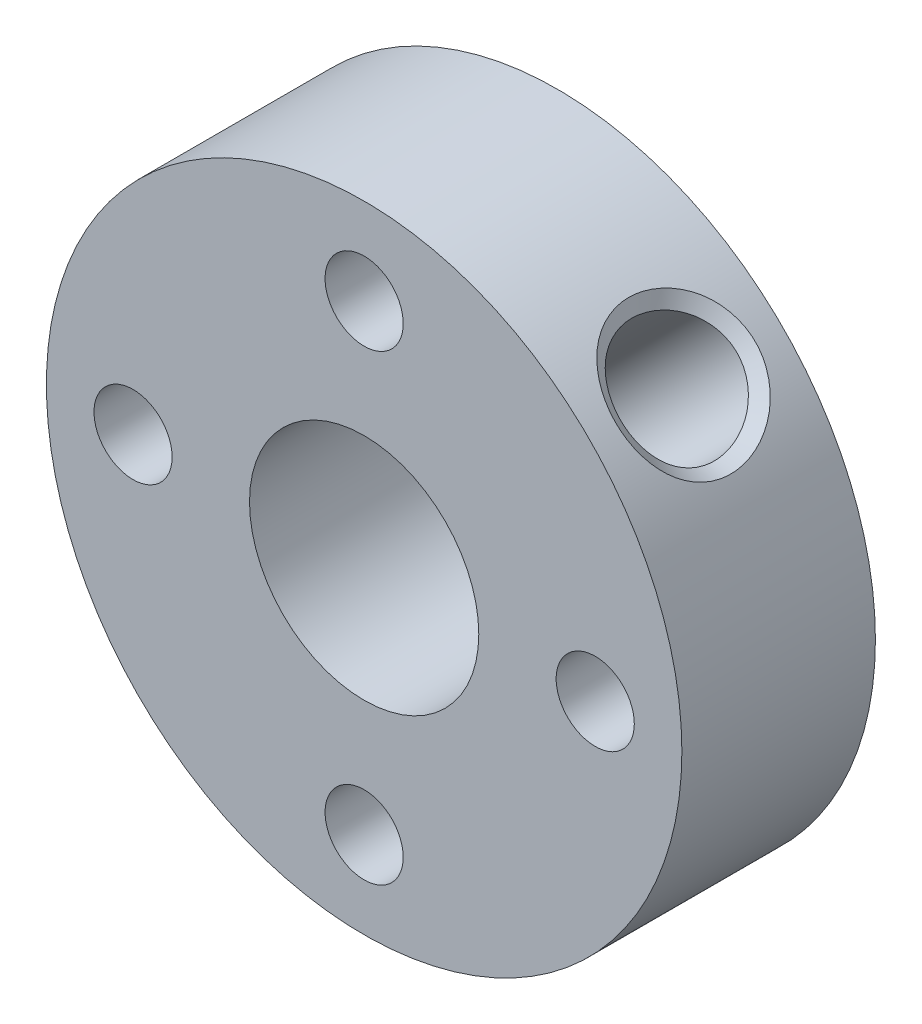
ISO-10303-21;
HEADER;
FILE_DESCRIPTION(('STEP AP214'),'2;1');
FILE_NAME('part.step','',(''),(''),'','','');
FILE_SCHEMA(('AUTOMOTIVE_DESIGN { 1 0 10303 214 1 1 1 1 }'));
ENDSEC;
DATA;
#1=APPLICATION_CONTEXT('core data for automotive mechanical design processes');
#2=APPLICATION_PROTOCOL_DEFINITION('international standard','automotive_design',2000,#1);
#3=PRODUCT_CONTEXT('',#1,'mechanical');
#4=PRODUCT('Part','Part','',(#3));
#5=PRODUCT_RELATED_PRODUCT_CATEGORY('part','',(#4));
#6=PRODUCT_DEFINITION_FORMATION('','',#4);
#7=PRODUCT_DEFINITION_CONTEXT('part definition',#1,'design');
#8=PRODUCT_DEFINITION('design','',#6,#7);
#9=PRODUCT_DEFINITION_SHAPE('','',#8);
#10=(LENGTH_UNIT() NAMED_UNIT(*) SI_UNIT(.MILLI.,.METRE.));
#11=(NAMED_UNIT(*) PLANE_ANGLE_UNIT() SI_UNIT($,.RADIAN.));
#12=(NAMED_UNIT(*) SI_UNIT($,.STERADIAN.) SOLID_ANGLE_UNIT());
#13=UNCERTAINTY_MEASURE_WITH_UNIT(LENGTH_MEASURE(1.E-05),#10,'distance_accuracy_value','');
#14=(GEOMETRIC_REPRESENTATION_CONTEXT(3) GLOBAL_UNCERTAINTY_ASSIGNED_CONTEXT((#13)) GLOBAL_UNIT_ASSIGNED_CONTEXT((#10,
#11,#12)) REPRESENTATION_CONTEXT('',''));
#15=CARTESIAN_POINT('',(0.,0.,0.));
#16=DIRECTION('',(0.,0.,1.));
#17=DIRECTION('',(1.,0.,0.));
#18=AXIS2_PLACEMENT_3D('',#15,#16,#17);
#19=CARTESIAN_POINT('',(0.,0.,-3.35));
#20=DIRECTION('',(0.,0.,1.));
#21=DIRECTION('',(1.,0.,0.));
#22=AXIS2_PLACEMENT_3D('',#19,#20,#21);
#23=CYLINDRICAL_SURFACE('',#22,11.);
#24=CARTESIAN_POINT('',(5.8085092111497,9.34137145948008,0.));
#25=CARTESIAN_POINT('',(5.80860175270185,9.34130684226353,0.637752239425181));
#26=CARTESIAN_POINT('',(6.04841944563921,9.19795689630476,1.26506432985481));
#27=CARTESIAN_POINT('',(6.80772994268231,8.65475782457621,2.1593530444314));
#28=CARTESIAN_POINT('',(7.31255506753503,8.2438399198522,2.42181611028022));
#29=CARTESIAN_POINT('',(8.24208780154511,7.31421539613682,2.42137394363942));
#30=CARTESIAN_POINT('',(8.65342910417239,6.80927509037896,2.16023058528548));
#31=CARTESIAN_POINT('',(9.19833006953286,6.04820111625001,1.26575073384544));
#32=CARTESIAN_POINT('',(9.34130756360717,5.80859981124356,0.640244269694809));
#33=CARTESIAN_POINT('',(9.34143535072447,5.80841861849953,-0.63996115444348));
#34=CARTESIAN_POINT('',(9.19862099961548,6.04773368941901,-1.26485137218771));
#35=CARTESIAN_POINT('',(8.65403117260026,6.80850255677219,-2.15966842361701));
#36=CARTESIAN_POINT('',(8.24214650834189,7.31418190369821,-2.42143639363606));
#37=CARTESIAN_POINT('',(7.31242801405934,8.24394174367863,-2.42175361413118));
#38=CARTESIAN_POINT('',(6.80825671047603,8.65433029295559,-2.15959971653595));
#39=CARTESIAN_POINT('',(6.04869975760827,9.19780320357039,-1.26576913530238));
#40=CARTESIAN_POINT('',(5.80841666959755,9.34143607669663,-0.637752239425182));
#41=CARTESIAN_POINT('',(5.8085092111497,9.34137145948008,0.));
#42=B_SPLINE_CURVE_WITH_KNOTS('',3,(#24,#25,#26,#27,#28,#29,#30,#31,#32,#33,#34,#35,#36,#37,#38,
#39,#40,#41),.UNSPECIFIED.,.T.,.F.,(4,2,2,2,2,2,2,2,4),(-3.18999496817796E-06,
0.00189587305523978,0.00379493610544774,0.0056939991556557,0.00759306220586365,
0.00949212525607161,0.0113911883062796,0.0132902513564875,0.0151893144066955),.UNSPECIFIED.);
#43=CARTESIAN_POINT('',(5.8085092111497,9.34137145948008,0.));
#44=VERTEX_POINT('',#43);
#45=EDGE_CURVE('E10',#44,#44,#42,.F.);
#46=ORIENTED_EDGE('',*,*,#45,.T.);
#47=EDGE_LOOP('',(#46));
#48=FACE_BOUND('',#47,.T.);
#49=CARTESIAN_POINT('',(0.,0.,-3.35));
#50=DIRECTION('',(0.,0.,1.));
#51=DIRECTION('',(1.,0.,0.));
#52=AXIS2_PLACEMENT_3D('',#49,#50,#51);
#53=CIRCLE('',#52,11.);
#54=CARTESIAN_POINT('',(11.,0.,-3.35));
#55=VERTEX_POINT('',#54);
#56=EDGE_CURVE('E49',#55,#55,#53,.T.);
#57=ORIENTED_EDGE('',*,*,#56,.T.);
#58=EDGE_LOOP('',(#57));
#59=FACE_BOUND('',#58,.T.);
#60=CARTESIAN_POINT('',(0.,0.,3.35));
#61=DIRECTION('',(0.,0.,1.));
#62=DIRECTION('',(1.,0.,0.));
#63=AXIS2_PLACEMENT_3D('',#60,#61,#62);
#64=CIRCLE('',#63,11.);
#65=CARTESIAN_POINT('',(11.,0.,3.35));
#66=VERTEX_POINT('',#65);
#67=EDGE_CURVE('E54',#66,#66,#64,.T.);
#68=ORIENTED_EDGE('',*,*,#67,.F.);
#69=EDGE_LOOP('',(#68));
#70=FACE_BOUND('',#69,.T.);
#71=ADVANCED_FACE('F32',(#48,#59,#70),#23,.T.);
#72=CARTESIAN_POINT('',(0.,0.,-3.35));
#73=DIRECTION('',(0.,0.,1.));
#74=DIRECTION('',(1.,0.,0.));
#75=AXIS2_PLACEMENT_3D('',#72,#73,#74);
#76=PLANE('',#75);
#77=CARTESIAN_POINT('',(0.,8.,-3.35));
#78=DIRECTION('',(0.,0.,1.));
#79=DIRECTION('',(1.,0.,0.));
#80=AXIS2_PLACEMENT_3D('',#77,#78,#79);
#81=CIRCLE('',#80,1.35255);
#82=CARTESIAN_POINT('',(1.35255,8.,-3.35));
#83=VERTEX_POINT('',#82);
#84=EDGE_CURVE('E177',#83,#83,#81,.T.);
#85=ORIENTED_EDGE('',*,*,#84,.T.);
#86=EDGE_LOOP('',(#85));
#87=FACE_BOUND('',#86,.T.);
#88=CARTESIAN_POINT('',(-8.,0.,-3.35));
#89=DIRECTION('',(0.,0.,1.));
#90=DIRECTION('',(1.,0.,0.));
#91=AXIS2_PLACEMENT_3D('',#88,#89,#90);
#92=CIRCLE('',#91,1.35255);
#93=CARTESIAN_POINT('',(-6.64745,0.,-3.35));
#94=VERTEX_POINT('',#93);
#95=EDGE_CURVE('E171',#94,#94,#92,.T.);
#96=ORIENTED_EDGE('',*,*,#95,.T.);
#97=EDGE_LOOP('',(#96));
#98=FACE_BOUND('',#97,.T.);
#99=CARTESIAN_POINT('',(8.,0.,-3.35));
#100=DIRECTION('',(0.,0.,1.));
#101=DIRECTION('',(1.,0.,0.));
#102=AXIS2_PLACEMENT_3D('',#99,#100,#101);
#103=CIRCLE('',#102,1.35255);
#104=CARTESIAN_POINT('',(9.35255,0.,-3.35));
#105=VERTEX_POINT('',#104);
#106=EDGE_CURVE('E158',#105,#105,#103,.T.);
#107=ORIENTED_EDGE('',*,*,#106,.T.);
#108=EDGE_LOOP('',(#107));
#109=FACE_BOUND('',#108,.T.);
#110=CARTESIAN_POINT('',(0.,-8.,-3.35));
#111=DIRECTION('',(0.,0.,1.));
#112=DIRECTION('',(1.,0.,0.));
#113=AXIS2_PLACEMENT_3D('',#110,#111,#112);
#114=CIRCLE('',#113,1.35255);
#115=CARTESIAN_POINT('',(1.35255,-8.,-3.35));
#116=VERTEX_POINT('',#115);
#117=EDGE_CURVE('E163',#116,#116,#114,.T.);
#118=ORIENTED_EDGE('',*,*,#117,.T.);
#119=EDGE_LOOP('',(#118));
#120=FACE_BOUND('',#119,.T.);
#121=CARTESIAN_POINT('',(0.,0.,-3.35));
#122=DIRECTION('',(0.,0.,1.));
#123=DIRECTION('',(1.,0.,0.));
#124=AXIS2_PLACEMENT_3D('',#121,#122,#123);
#125=CIRCLE('',#124,3.96875);
#126=CARTESIAN_POINT('',(3.96875,0.,-3.35));
#127=VERTEX_POINT('',#126);
#128=EDGE_CURVE('E59',#127,#127,#125,.T.);
#129=ORIENTED_EDGE('',*,*,#128,.T.);
#130=EDGE_LOOP('',(#129));
#131=FACE_BOUND('',#130,.T.);
#132=ORIENTED_EDGE('',*,*,#56,.F.);
#133=EDGE_LOOP('',(#132));
#134=FACE_BOUND('',#133,.T.);
#135=ADVANCED_FACE('F103',(#87,#98,#109,#120,#131,#134),#76,.F.);
#136=CARTESIAN_POINT('',(0.,0.,3.35));
#137=DIRECTION('',(0.,0.,1.));
#138=DIRECTION('',(1.,0.,0.));
#139=AXIS2_PLACEMENT_3D('',#136,#137,#138);
#140=PLANE('',#139);
#141=CARTESIAN_POINT('',(0.,8.,3.35));
#142=DIRECTION('',(0.,0.,1.));
#143=DIRECTION('',(1.,0.,0.));
#144=AXIS2_PLACEMENT_3D('',#141,#142,#143);
#145=CIRCLE('',#144,1.35254999999999);
#146=CARTESIAN_POINT('',(1.35254999999999,8.,3.35));
#147=VERTEX_POINT('',#146);
#148=EDGE_CURVE('E174',#147,#147,#145,.T.);
#149=ORIENTED_EDGE('',*,*,#148,.F.);
#150=EDGE_LOOP('',(#149));
#151=FACE_BOUND('',#150,.T.);
#152=CARTESIAN_POINT('',(-8.,0.,3.35));
#153=DIRECTION('',(0.,0.,1.));
#154=DIRECTION('',(1.,0.,0.));
#155=AXIS2_PLACEMENT_3D('',#152,#153,#154);
#156=CIRCLE('',#155,1.35254999999999);
#157=CARTESIAN_POINT('',(-6.64745000000001,0.,3.35));
#158=VERTEX_POINT('',#157);
#159=EDGE_CURVE('E166',#158,#158,#156,.T.);
#160=ORIENTED_EDGE('',*,*,#159,.F.);
#161=EDGE_LOOP('',(#160));
#162=FACE_BOUND('',#161,.T.);
#163=CARTESIAN_POINT('',(8.,0.,3.35));
#164=DIRECTION('',(0.,0.,1.));
#165=DIRECTION('',(1.,0.,0.));
#166=AXIS2_PLACEMENT_3D('',#163,#164,#165);
#167=CIRCLE('',#166,1.35254999999999);
#168=CARTESIAN_POINT('',(9.35254999999999,0.,3.35));
#169=VERTEX_POINT('',#168);
#170=EDGE_CURVE('E161',#169,#169,#167,.T.);
#171=ORIENTED_EDGE('',*,*,#170,.F.);
#172=EDGE_LOOP('',(#171));
#173=FACE_BOUND('',#172,.T.);
#174=CARTESIAN_POINT('',(0.,-8.,3.35));
#175=DIRECTION('',(0.,0.,1.));
#176=DIRECTION('',(1.,0.,0.));
#177=AXIS2_PLACEMENT_3D('',#174,#175,#176);
#178=CIRCLE('',#177,1.35254999999999);
#179=CARTESIAN_POINT('',(1.35254999999999,-8.,3.35));
#180=VERTEX_POINT('',#179);
#181=EDGE_CURVE('E91',#180,#180,#178,.T.);
#182=ORIENTED_EDGE('',*,*,#181,.F.);
#183=EDGE_LOOP('',(#182));
#184=FACE_BOUND('',#183,.T.);
#185=CARTESIAN_POINT('',(0.,0.,3.35));
#186=DIRECTION('',(0.,0.,1.));
#187=DIRECTION('',(1.,0.,0.));
#188=AXIS2_PLACEMENT_3D('',#185,#186,#187);
#189=CIRCLE('',#188,3.96875);
#190=CARTESIAN_POINT('',(3.96875,0.,3.35));
#191=VERTEX_POINT('',#190);
#192=EDGE_CURVE('E62',#191,#191,#189,.T.);
#193=ORIENTED_EDGE('',*,*,#192,.F.);
#194=EDGE_LOOP('',(#193));
#195=FACE_BOUND('',#194,.T.);
#196=ORIENTED_EDGE('',*,*,#67,.T.);
#197=EDGE_LOOP('',(#196));
#198=FACE_BOUND('',#197,.T.);
#199=ADVANCED_FACE('F100',(#151,#162,#173,#184,#195,#198),#140,.T.);
#200=CARTESIAN_POINT('',(0.,0.,-3.35));
#201=DIRECTION('',(0.,0.,1.));
#202=DIRECTION('',(1.,0.,0.));
#203=AXIS2_PLACEMENT_3D('',#200,#201,#202);
#204=CYLINDRICAL_SURFACE('',#203,3.96875);
#205=CARTESIAN_POINT('',(0.988066021552106,3.84378746805208,0.));
#206=CARTESIAN_POINT('',(0.988079902541116,3.84378895007629,0.104927856551472));
#207=CARTESIAN_POINT('',(0.997359113943265,3.84143565622422,0.209985951877965));
#208=CARTESIAN_POINT('',(1.0336680659886,3.83181885188441,0.416851766777404));
#209=CARTESIAN_POINT('',(1.06073378291078,3.82454538862704,0.518652459109406));
#210=CARTESIAN_POINT('',(1.13022299693377,3.80458397320029,0.715620498990882));
#211=CARTESIAN_POINT('',(1.17256250905059,3.79192556393313,0.810820791319395));
#212=CARTESIAN_POINT('',(1.26993094348076,3.7604338013933,0.993320316996597));
#213=CARTESIAN_POINT('',(1.32496093160809,3.7415999294162,1.08061888585833));
#214=CARTESIAN_POINT('',(1.4502174154329,3.6949530461915,1.25308159207338));
#215=CARTESIAN_POINT('',(1.52134137800284,3.66650955234386,1.33742373732139));
#216=CARTESIAN_POINT('',(1.6723052454782,3.60016282906435,1.49374573019937));
#217=CARTESIAN_POINT('',(1.75214959794203,3.56225475973178,1.56571922097949));
#218=CARTESIAN_POINT('',(1.92334854127002,3.47298942710684,1.70022656254003));
#219=CARTESIAN_POINT('',(2.0151177350485,3.42087311221871,1.76173889279822));
#220=CARTESIAN_POINT('',(2.20120105356201,3.30419656521406,1.86639760992893));
#221=CARTESIAN_POINT('',(2.29551347325045,3.23964450033303,1.90955599149707));
#222=CARTESIAN_POINT('',(2.47562329768691,3.10387451128038,1.97299149618751));
#223=CARTESIAN_POINT('',(2.56153840302111,3.03349117405402,1.99471305588314));
#224=CARTESIAN_POINT('',(2.72850970041959,2.88421930798347,2.01942570035065));
#225=CARTESIAN_POINT('',(2.80956892130637,2.80533616861374,2.02242858381395));
#226=CARTESIAN_POINT('',(2.95694466876338,2.64914129463903,2.01015199009899));
#227=CARTESIAN_POINT('',(3.02393145385511,2.57232673696917,1.99649311009036));
#228=CARTESIAN_POINT('',(3.14995684203534,2.41636142335379,1.95419547289651));
#229=CARTESIAN_POINT('',(3.20899484801796,2.33721049244571,1.92555559113911));
#230=CARTESIAN_POINT('',(3.31908779594534,2.17810180971991,1.85395095981867));
#231=CARTESIAN_POINT('',(3.37002491830902,2.09814749264745,1.81079905149489));
#232=CARTESIAN_POINT('',(3.46290403064262,1.94103413705174,1.71166853890331));
#233=CARTESIAN_POINT('',(3.50484283192848,1.86387609745267,1.65568540219259));
#234=CARTESIAN_POINT('',(3.58382388815284,1.70750678416115,1.5262546139572));
#235=CARTESIAN_POINT('',(3.6199970261924,1.62882188057161,1.45163987808151));
#236=CARTESIAN_POINT('',(3.68305818293236,1.48072646230621,1.29017340154659));
#237=CARTESIAN_POINT('',(3.70993863236889,1.41132353624781,1.20331176599065));
#238=CARTESIAN_POINT('',(3.75708089385763,1.28080324032226,1.01266300006345));
#239=CARTESIAN_POINT('',(3.77677370342606,1.2205609670457,0.908129278653179));
#240=CARTESIAN_POINT('',(3.80819276088697,1.11871027030587,0.689253213204128));
#241=CARTESIAN_POINT('',(3.8199275534277,1.0770818772442,0.574921538480598));
#242=CARTESIAN_POINT('',(3.83586302371067,1.01881432623523,0.349292450928628));
#243=CARTESIAN_POINT('',(3.84059152655263,1.00044180772154,0.238484555747576));
#244=CARTESIAN_POINT('',(3.84467034847992,0.984666788253275,0.0153190940584518));
#245=CARTESIAN_POINT('',(3.84402479071221,0.987248210743566,-0.0970372183887345));
#246=CARTESIAN_POINT('',(3.83768926688075,1.01154768021783,-0.306285889223869));
#247=CARTESIAN_POINT('',(3.83258914996281,1.03102629884983,-0.403468276542667));
#248=CARTESIAN_POINT('',(3.81777315440258,1.08459721795761,-0.593338244190524));
#249=CARTESIAN_POINT('',(3.80805571029018,1.11869447438943,-0.686024288313387));
#250=CARTESIAN_POINT('',(3.78285711500173,1.2012088615821,-0.869141295505289));
#251=CARTESIAN_POINT('',(3.76713121285842,1.25021297597341,-0.959271996815906));
#252=CARTESIAN_POINT('',(3.72917596633653,1.35924768170892,-1.13110010124883));
#253=CARTESIAN_POINT('',(3.70694326990453,1.4192839504532,-1.21279312818116));
#254=CARTESIAN_POINT('',(3.65168327891228,1.55638441929068,-1.37666632676823));
#255=CARTESIAN_POINT('',(3.61762119365603,1.63464956857404,-1.45749894372438));
#256=CARTESIAN_POINT('',(3.5388740045432,1.79878642690377,-1.60513146946906));
#257=CARTESIAN_POINT('',(3.49418491253164,1.88466098403699,-1.6719260922397));
#258=CARTESIAN_POINT('',(3.39186160946718,2.06328504915796,-1.7913214795364));
#259=CARTESIAN_POINT('',(3.33387882619923,2.15616359207096,-1.8434355346827));
#260=CARTESIAN_POINT('',(3.20579420795771,2.34234537613327,-1.928449225566));
#261=CARTESIAN_POINT('',(3.13570345543774,2.43564815359813,-1.96136631281111));
#262=CARTESIAN_POINT('',(2.99180655270109,2.60990913364403,-2.00412288627952));
#263=CARTESIAN_POINT('',(2.91896496918987,2.69120453013022,-2.01583680402985));
#264=CARTESIAN_POINT('',(2.76644500483723,2.84775021696145,-2.02143522084023));
#265=CARTESIAN_POINT('',(2.686769207402,2.92300277091989,-2.01532642849873));
#266=CARTESIAN_POINT('',(2.52910686050123,3.06019007046344,-1.98666783402269));
#267=CARTESIAN_POINT('',(2.45139014021031,3.12268763272809,-1.96529456057147));
#268=CARTESIAN_POINT('',(2.29496968590167,3.23938550840543,-1.90833748226343));
#269=CARTESIAN_POINT('',(2.21626581647025,3.29358466970137,-1.87275170667011));
#270=CARTESIAN_POINT('',(2.05709684530155,3.39538335267928,-1.78685660207557));
#271=CARTESIAN_POINT('',(1.97669508431021,3.44261359261191,-1.73599535996841));
#272=CARTESIAN_POINT('',(1.82009903391039,3.52791441376144,-1.62168189898446));
#273=CARTESIAN_POINT('',(1.74390668086039,3.56598080613233,-1.55822394617094));
#274=CARTESIAN_POINT('',(1.59073453119501,3.63708393211849,-1.41297927787462));
#275=CARTESIAN_POINT('',(1.51447512494284,3.66920466515798,-1.32998035162024));
#276=CARTESIAN_POINT('',(1.37341431743566,3.72430605957277,-1.1519500326916));
#277=CARTESIAN_POINT('',(1.30862369799624,3.74727814538314,-1.05690746026233));
#278=CARTESIAN_POINT('',(1.19205946451786,3.78601440655319,-0.852732732091956));
#279=CARTESIAN_POINT('',(1.14085832928895,3.80147936469973,-0.743208524542081));
#280=CARTESIAN_POINT('',(1.07955124122097,3.81916083666133,-0.573071983833455));
#281=CARTESIAN_POINT('',(1.0617070600374,3.82413333843385,-0.515439060599892));
#282=CARTESIAN_POINT('',(1.03157037760657,3.83237342500356,-0.398634079647876));
#283=CARTESIAN_POINT('',(1.01927404506659,3.83564218663078,-0.33946311404502));
#284=CARTESIAN_POINT('',(1.00268476754273,3.84000721976838,-0.233567736576124));
#285=CARTESIAN_POINT('',(0.997213623023877,3.8414268032206,-0.187038031107455));
#286=CARTESIAN_POINT('',(0.989901029667686,3.84331662818391,-0.0936808862691912));
#287=CARTESIAN_POINT('',(0.988059823275216,3.84378680628393,-0.0468534272220692));
#288=CARTESIAN_POINT('',(0.988066021552106,3.84378746805208,0.));
#289=B_SPLINE_CURVE_WITH_KNOTS('',3,(#205,#206,#207,#208,#209,#210,#211,#212,#213,#214,#215,
#216,#217,#218,#219,#220,#221,#222,#223,#224,#225,#226,#227,#228,#229,#230,#231,#232,#233,#234,
#235,#236,#237,#238,#239,#240,#241,#242,#243,#244,#245,#246,#247,#248,#249,#250,#251,#252,#253,
#254,#255,#256,#257,#258,#259,#260,#261,#262,#263,#264,#265,#266,#267,#268,#269,#270,#271,#272,
#273,#274,#275,#276,#277,#278,#279,#280,#281,#282,#283,#284,#285,#286,#287,#288),.UNSPECIFIED.,
.T.,.F.,(4,2,2,2,2,2,2,2,2,2,2,2,2,2,2,2,2,2,2,2,2,2,2,2,2,2,2,2,2,2,2,2,2,2,2,2,2,2,2,2,2,4),
(0.,0.314593776156156,0.629825839217223,0.943350337013716,1.25690117586846,1.59728492965321,
1.93784310329725,2.30238105637919,2.66668040869054,3.00429585897964,3.34169848312726,
3.64874422629698,3.95581302164109,4.26700442383123,4.57830591968884,4.91979290400179,
5.26155739123993,5.62638332394284,5.99081691444654,6.32608302237146,6.66109192739968,
6.95749709235775,7.25400282304616,7.56415893350386,7.8744751067143,8.22558245452992,
8.57682177615261,8.93861329742309,9.30007540784797,9.62764581054904,9.95509292926405,
10.2596996913262,10.5643487054978,10.8816969366481,11.199189955173,11.549239007761,
11.8996154139391,12.2629980465975,12.4443643777116,12.6256052664879,12.7660714182122,
12.9065469514031),.UNSPECIFIED.);
#290=CARTESIAN_POINT('',(0.988066021552106,3.84378746805208,0.));
#291=VERTEX_POINT('',#290);
#292=EDGE_CURVE('E86',#291,#291,#289,.T.);
#293=ORIENTED_EDGE('',*,*,#292,.T.);
#294=EDGE_LOOP('',(#293));
#295=FACE_BOUND('',#294,.T.);
#296=ORIENTED_EDGE('',*,*,#128,.F.);
#297=EDGE_LOOP('',(#296));
#298=FACE_BOUND('',#297,.T.);
#299=ORIENTED_EDGE('',*,*,#192,.T.);
#300=EDGE_LOOP('',(#299));
#301=FACE_BOUND('',#300,.T.);
#302=ADVANCED_FACE('F80',(#295,#298,#301),#204,.F.);
#303=CARTESIAN_POINT('',(7.77817459305204,7.77817459305201,0.));
#304=DIRECTION('',(0.707106781186549,0.707106781186546,0.));
#305=DIRECTION('',(-0.707106781186546,0.707106781186549,0.));
#306=AXIS2_PLACEMENT_3D('',#303,#304,#305);
#307=CYLINDRICAL_SURFACE('',#306,2.01929999999999);
#308=CARTESIAN_POINT('',(5.91506401697902,8.77078546347897,0.));
#309=CARTESIAN_POINT('',(5.91505848231522,8.77078895441068,-0.0332110676749006));
#310=CARTESIAN_POINT('',(5.91584250371787,8.77036908136087,-0.0664205027333988));
#311=CARTESIAN_POINT('',(5.91894801804011,8.7686844720424,-0.132706000824386));
#312=CARTESIAN_POINT('',(5.9212676546673,8.76742075581777,-0.1657821764358));
#313=CARTESIAN_POINT('',(5.92740096477233,8.76405141279832,-0.231730396913027));
#314=CARTESIAN_POINT('',(5.93121367555311,8.7619463284787,-0.264602559475332));
#315=CARTESIAN_POINT('',(5.94028892447994,8.75689761117119,-0.330073394505811));
#316=CARTESIAN_POINT('',(5.94555114052323,8.7539541644756,-0.3626721260782));
#317=CARTESIAN_POINT('',(5.95748172497235,8.74723181556497,-0.427526437618048));
#318=CARTESIAN_POINT('',(5.96415019887331,8.74345285066972,-0.459781991650093));
#319=CARTESIAN_POINT('',(5.97884975539383,8.73506249034032,-0.523880394046924));
#320=CARTESIAN_POINT('',(5.9868811988934,8.73045087442044,-0.555723130698293));
#321=CARTESIAN_POINT('',(6.00426333819006,8.72039813550141,-0.618926309415737));
#322=CARTESIAN_POINT('',(6.01361451659092,8.71495670899628,-0.650286570375665));
#323=CARTESIAN_POINT('',(6.03359289306655,8.70324720139475,-0.712455190591761));
#324=CARTESIAN_POINT('',(6.04422059736453,8.69697879224987,-0.743263325292283));
#325=CARTESIAN_POINT('',(6.0667088867097,8.68361811087546,-0.804258051751255));
#326=CARTESIAN_POINT('',(6.07856993563722,8.67652552854269,-0.834444404496173));
#327=CARTESIAN_POINT('',(6.10348184418441,8.66151925847352,-0.894125891486487));
#328=CARTESIAN_POINT('',(6.11653308800739,8.65360530547821,-0.923620798638443));
#329=CARTESIAN_POINT('',(6.1437823270195,8.63695899466251,-0.981849692064882));
#330=CARTESIAN_POINT('',(6.15798061459985,8.62822642807898,-1.01058348182968));
#331=CARTESIAN_POINT('',(6.18748098358666,8.60994569245589,-1.06722040540461));
#332=CARTESIAN_POINT('',(6.20278327541986,8.60039736786602,-1.09512337941919));
#333=CARTESIAN_POINT('',(6.23444834486617,8.58048749877546,-1.15002897367341));
#334=CARTESIAN_POINT('',(6.25081127954805,8.57012583378044,-1.17703145966051));
#335=CARTESIAN_POINT('',(6.28455556770698,8.54859326407028,-1.23006622575013));
#336=CARTESIAN_POINT('',(6.30193706947595,8.53742224146553,-1.25609836367374));
#337=CARTESIAN_POINT('',(6.33767164204863,8.51426907303072,-1.30712323462615));
#338=CARTESIAN_POINT('',(6.35602490834892,8.50228676385234,-1.33211575668862));
#339=CARTESIAN_POINT('',(6.39367379710447,8.47753119815555,-1.38098995191832));
#340=CARTESIAN_POINT('',(6.41296973283743,8.46475767831074,-1.40487125057306));
#341=CARTESIAN_POINT('',(6.45239380966424,8.43836765389058,-1.45144277207452));
#342=CARTESIAN_POINT('',(6.47252179241437,8.42475130946691,-1.47413321969915));
#343=CARTESIAN_POINT('',(6.51347588006849,8.39664993352501,-1.51827896365429));
#344=CARTESIAN_POINT('',(6.53430150189428,8.38216549784592,-1.53973508781516));
#345=CARTESIAN_POINT('',(6.57659692078657,8.35237560191873,-1.58137915482345));
#346=CARTESIAN_POINT('',(6.59806639414691,8.33707055129586,-1.60156771966927));
#347=CARTESIAN_POINT('',(6.64157796071985,8.30566497179512,-1.64064582304461));
#348=CARTESIAN_POINT('',(6.66361982921346,8.28956475292207,-1.65953586105512));
#349=CARTESIAN_POINT('',(6.70820943365554,8.2566002077917,-1.69598536565465));
#350=CARTESIAN_POINT('',(6.73075699607695,8.23973614168033,-1.71354527988383));
#351=CARTESIAN_POINT('',(6.77629000761415,8.20527364445818,-1.74730308237524));
#352=CARTESIAN_POINT('',(6.7992753094278,8.18767545809094,-1.76350141922008));
#353=CARTESIAN_POINT('',(6.84561618019306,8.15177485327989,-1.79450451369917));
#354=CARTESIAN_POINT('',(6.86897161775489,8.13347268158225,-1.80930975345407));
#355=CARTESIAN_POINT('',(6.915985056941,8.09619410943873,-1.83749507829371));
#356=CARTESIAN_POINT('',(6.93964294335845,8.07721796109371,-1.8508756889275));
#357=CARTESIAN_POINT('',(6.98719359976604,8.03862146663374,-1.87618016635322));
#358=CARTESIAN_POINT('',(7.01108627669855,8.01900136905855,-1.88810458698168));
#359=CARTESIAN_POINT('',(7.05903882080187,7.97914700798319,-1.91046511062842));
#360=CARTESIAN_POINT('',(7.08309862402777,7.95891297037338,-1.92090175318899));
#361=CARTESIAN_POINT('',(7.13131772267692,7.91786078233942,-1.94025519102211));
#362=CARTESIAN_POINT('',(7.15547698625861,7.89704280807244,-1.94917243903047));
#363=CARTESIAN_POINT('',(7.20382730656836,7.85485282469412,-1.96545562647138));
#364=CARTESIAN_POINT('',(7.2280183572575,7.83348090947037,-1.97282182688519));
#365=CARTESIAN_POINT('',(7.27636455934795,7.79021315756589,-1.9859715835014));
#366=CARTESIAN_POINT('',(7.30051970910262,7.76831729759627,-1.99175506921085));
#367=CARTESIAN_POINT('',(7.34872645183661,7.72403178920512,-2.0017081311534));
#368=CARTESIAN_POINT('',(7.37277800466266,7.7016419668764,-2.00587712907823));
#369=CARTESIAN_POINT('',(7.42070990754527,7.65639875033491,-2.01257039611203));
#370=CARTESIAN_POINT('',(7.4445901076154,7.63354500443548,-2.01509336544913));
#371=CARTESIAN_POINT('',(7.49211187188735,7.58740398851407,-2.01846297530972));
#372=CARTESIAN_POINT('',(7.51575306944566,7.56411617370422,-2.01930734284276));
#373=CARTESIAN_POINT('',(7.56268537381162,7.51718143523515,-2.01929214610317));
#374=CARTESIAN_POINT('',(7.58597640723569,7.49353443833364,-2.01843222954557));
#375=CARTESIAN_POINT('',(7.63213269087667,7.44599278654124,-2.01503739250119));
#376=CARTESIAN_POINT('',(7.65499833438957,7.4220983958268,-2.01250410727608));
#377=CARTESIAN_POINT('',(7.70027314745174,7.37413068840907,-2.00579376995032));
#378=CARTESIAN_POINT('',(7.7226825250674,7.35005746041973,-2.00161748558656));
#379=CARTESIAN_POINT('',(7.76701398076268,7.30180085174932,-1.99165308065752));
#380=CARTESIAN_POINT('',(7.78893610238857,7.2776174811464,-1.98586510476038));
#381=CARTESIAN_POINT('',(7.83226222533887,7.22920923113275,-1.97270874422235));
#382=CARTESIAN_POINT('',(7.85366613690357,7.2049843452983,-1.96534008793903));
#383=CARTESIAN_POINT('',(7.89592497299628,7.1565616692253,-1.94905366064103));
#384=CARTESIAN_POINT('',(7.91677971060388,7.13236389082918,-1.94013536983414));
#385=CARTESIAN_POINT('',(7.95790929380115,7.08406400516903,-1.92078078423956));
#386=CARTESIAN_POINT('',(7.97818389178885,7.05996194242694,-1.91034385253155));
#387=CARTESIAN_POINT('',(8.01812224950333,7.01192205696619,-1.88798297317344));
#388=CARTESIAN_POINT('',(8.03778573410585,6.98798431189646,-1.87605836754498));
#389=CARTESIAN_POINT('',(8.07647088550343,6.94034163726294,-1.85075303378894));
#390=CARTESIAN_POINT('',(8.09549227656628,6.91663681074189,-1.83737169026327));
#391=CARTESIAN_POINT('',(8.13286222382865,6.86952855499724,-1.80918371284058));
#392=CARTESIAN_POINT('',(8.15121052192307,6.8461252435794,-1.79437653992198));
#393=CARTESIAN_POINT('',(8.18720327904014,6.79968863480246,-1.76336770394078));
#394=CARTESIAN_POINT('',(8.20484750501893,6.77665546143919,-1.74716558467095));
#395=CARTESIAN_POINT('',(8.23940098478744,6.73102767566809,-1.71339764848219));
#396=CARTESIAN_POINT('',(8.25631002512714,6.70843319166701,-1.69583143959049));
#397=CARTESIAN_POINT('',(8.28936245658593,6.66375163283349,-1.65936614329798));
#398=CARTESIAN_POINT('',(8.30550563361525,6.6416647007617,-1.64046668682979));
#399=CARTESIAN_POINT('',(8.33699399859716,6.59806596681262,-1.6013657262551));
#400=CARTESIAN_POINT('',(8.35233893380896,6.57655434812704,-1.5811638142422));
#401=CARTESIAN_POINT('',(8.38220479917344,6.53417810328663,-1.53948894405403));
#402=CARTESIAN_POINT('',(8.39672538327564,6.51331375048718,-1.51801545970707));
#403=CARTESIAN_POINT('',(8.42489311596826,6.4722882785207,-1.47382811571226));
#404=CARTESIAN_POINT('',(8.43853973376537,6.45212759003505,-1.45111351751843));
#405=CARTESIAN_POINT('',(8.46498311220623,6.41264578919863,-1.40450223516731));
#406=CARTESIAN_POINT('',(8.47778006619722,6.39332448618789,-1.38060582211521));
#407=CARTESIAN_POINT('',(8.50257514167932,6.35563320480251,-1.33172197410269));
#408=CARTESIAN_POINT('',(8.51457408105177,6.33726225684294,-1.30673570103524));
#409=CARTESIAN_POINT('',(8.5377528699454,6.3015013268,-1.25573829303499));
#410=CARTESIAN_POINT('',(8.54893337535542,6.28411056183228,-1.22972800503158));
#411=CARTESIAN_POINT('',(8.57047851389437,6.25035520776226,-1.17674891016928));
#412=CARTESIAN_POINT('',(8.58084366898023,6.23398996354728,-1.14978073283482));
#413=CARTESIAN_POINT('',(8.6007549766637,6.20232675855256,-1.09495202742266));
#414=CARTESIAN_POINT('',(8.61030156068651,6.18702823636469,-1.06709198016873));
#415=CARTESIAN_POINT('',(8.62857424193246,6.15754073429502,-1.01054566085374));
#416=CARTESIAN_POINT('',(8.63730070526259,6.14335125980823,-0.981859764999469));
#417=CARTESIAN_POINT('',(8.6539311832294,6.11612384324089,-0.923727827713148));
#418=CARTESIAN_POINT('',(8.66183551201453,6.10308546160267,-0.894282082037692));
#419=CARTESIAN_POINT('',(8.6768198664741,6.07820231388728,-0.83469650395604));
#420=CARTESIAN_POINT('',(8.68390015394206,6.06635716888693,-0.804556895651191));
#421=CARTESIAN_POINT('',(8.69723453927415,6.04390255145558,-0.743649643103453));
#422=CARTESIAN_POINT('',(8.70348883246057,6.03329278696552,-0.712882149330111));
#423=CARTESIAN_POINT('',(8.71516936551007,6.01335096704361,-0.650785178799458));
#424=CARTESIAN_POINT('',(8.7205957060608,6.00401875626215,-0.619455770895436));
#425=CARTESIAN_POINT('',(8.73061849592325,5.98667402839744,-0.556301032430911));
#426=CARTESIAN_POINT('',(8.73521490889621,5.97866156910145,-0.524475680221507));
#427=CARTESIAN_POINT('',(8.74357604893016,5.96399825071929,-0.460395119679622));
#428=CARTESIAN_POINT('',(8.74734054591037,5.95734776834858,-0.42813979503959));
#429=CARTESIAN_POINT('',(8.75403611517923,5.94545020513706,-0.363265361084167));
#430=CARTESIAN_POINT('',(8.75696669272246,5.94020395750586,-0.330646047697548));
#431=CARTESIAN_POINT('',(8.76199275794242,5.931156514649,-0.265109684300495));
#432=CARTESIAN_POINT('',(8.76408740155926,5.92735678017527,-0.232192367504752));
#433=CARTESIAN_POINT('',(8.76744000846942,5.92124387879349,-0.166126063866238));
#434=CARTESIAN_POINT('',(8.76869668102399,5.91893300538346,-0.132976798738431));
#435=CARTESIAN_POINT('',(8.77037188909035,5.91583898922572,-0.0665124282631971));
#436=CARTESIAN_POINT('',(8.77078857901005,5.9150592106646,-0.0331971186146517));
#437=CARTESIAN_POINT('',(8.77078234422554,5.91506882985745,0.0334354198008893));
#438=CARTESIAN_POINT('',(8.77035936358661,5.91585833214921,0.0667526485478826));
#439=CARTESIAN_POINT('',(8.76867146473501,5.91897238819307,0.13322429658902));
#440=CARTESIAN_POINT('',(8.76740828879689,5.92129376528809,0.166378910068229));
#441=CARTESIAN_POINT('',(8.76404262761878,5.92742794695481,0.232458795725582));
#442=CARTESIAN_POINT('',(8.7619413437847,5.93123861650762,0.265384327842087));
#443=CARTESIAN_POINT('',(8.75690192757776,5.94030819641756,0.330939444120568));
#444=CARTESIAN_POINT('',(8.75396456516732,5.94556577413946,0.36356927220573));
#445=CARTESIAN_POINT('',(8.7472553538668,5.95748617552346,0.428466492217269));
#446=CARTESIAN_POINT('',(8.74348394143914,5.96414826411335,0.460734064467775));
#447=CARTESIAN_POINT('',(8.73510889001522,5.97883490576692,0.524840307220212));
#448=CARTESIAN_POINT('',(8.73050543884059,5.98685915131707,0.556679072780167));
#449=CARTESIAN_POINT('',(8.72046848535581,6.0042274881664,0.619861251959671));
#450=CARTESIAN_POINT('',(8.71503499303038,6.01357156358902,0.65120467153282));
#451=CARTESIAN_POINT('',(8.70334006221747,6.03353707477465,0.713329703342659));
#452=CARTESIAN_POINT('',(8.69707851221821,6.04415868256125,0.744111239275851));
#453=CARTESIAN_POINT('',(8.68372951263668,6.06663687147065,0.805046035453227));
#454=CARTESIAN_POINT('',(8.67664187185276,6.0784937384309,0.835199148335344));
#455=CARTESIAN_POINT('',(8.66164270405434,6.10340013586136,0.894810613656912));
#456=CARTESIAN_POINT('',(8.65373093354435,6.11645001867716,0.924268757591389));
#457=CARTESIAN_POINT('',(8.63708546101234,6.14370016084589,0.982423787635077));
#458=CARTESIAN_POINT('',(8.62835147637857,6.15790081550739,1.01112040761647));
#459=CARTESIAN_POINT('',(8.61006363456531,6.18741031938701,1.0676858834715));
#460=CARTESIAN_POINT('',(8.60050945492705,6.20271960408833,1.09555440793038));
#461=CARTESIAN_POINT('',(8.58058284492023,6.23440387837895,1.15039720437352));
#462=CARTESIAN_POINT('',(8.57021003759893,6.25077935830365,1.17737105617334));
#463=CARTESIAN_POINT('',(8.54864944445045,6.28455467519279,1.23035799961978));
#464=CARTESIAN_POINT('',(8.53746120026439,6.30195508720328,1.25637053833628));
#465=CARTESIAN_POINT('',(8.5142669232988,6.3377345712086,1.30736855221933));
#466=CARTESIAN_POINT('',(8.50226030619904,6.3561143403794,1.33235327267238));
#467=CARTESIAN_POINT('',(8.47744934140314,6.39382294388809,1.38122882200797));
#468=CARTESIAN_POINT('',(8.46464425050445,6.4131526587608,1.40511859474889));
#469=CARTESIAN_POINT('',(8.43818660196547,6.4526481078882,1.45171251711371));
#470=CARTESIAN_POINT('',(8.42453397317264,6.472813912287,1.47441656689831));
#471=CARTESIAN_POINT('',(8.39635830986087,6.51384425532208,1.51858066920913));
#472=CARTESIAN_POINT('',(8.38183596066716,6.53470823823055,1.5400416756681));
#473=CARTESIAN_POINT('',(8.35196972434899,6.57707948460711,1.58168918955006));
#474=CARTESIAN_POINT('',(8.33662631249606,6.59858637281448,1.60187641986011));
#475=CARTESIAN_POINT('',(8.30514387938477,6.6421718620316,1.64094629790072));
#476=CARTESIAN_POINT('',(8.28900521800496,6.66425020233021,1.65982952661447));
#477=CARTESIAN_POINT('',(8.25596425137546,6.7089114379051,1.69626108459567));
#478=CARTESIAN_POINT('',(8.23906224475767,6.73149413415179,1.71380992880571));
#479=CARTESIAN_POINT('',(8.20452486185036,6.77709580693245,1.74754235960537));
#480=CARTESIAN_POINT('',(8.1868897618932,6.80011461732841,1.76372645378098));
#481=CARTESIAN_POINT('',(8.15091686836598,6.84652057975221,1.79469895545694));
#482=CARTESIAN_POINT('',(8.13257935010047,6.86990758539569,1.80948790205611));
#483=CARTESIAN_POINT('',(8.09523215855354,6.91698192631167,1.83763964193118));
#484=CARTESIAN_POINT('',(8.07622276636988,6.94066913338687,1.85100302244686));
#485=CARTESIAN_POINT('',(8.03756239098396,6.98827588717756,1.87627314501539));
#486=CARTESIAN_POINT('',(8.01791168882148,7.01219532897691,1.88818051455554));
#487=CARTESIAN_POINT('',(7.97799925524322,7.06019855062092,1.91050813867076));
#488=CARTESIAN_POINT('',(7.95773778839227,7.08428225591072,1.92092902624327));
#489=CARTESIAN_POINT('',(7.91663440543887,7.13254599725071,1.94025324141825));
#490=CARTESIAN_POINT('',(7.8957927125758,7.15672599326698,1.94915714353737));
#491=CARTESIAN_POINT('',(7.85355948229104,7.20511430797543,1.96541702019326));
#492=CARTESIAN_POINT('',(7.83216809594916,7.22932261717638,1.97277341505298));
#493=CARTESIAN_POINT('',(7.78886610971863,7.27769954816383,1.98590795958635));
#494=CARTESIAN_POINT('',(7.76695555486784,7.30186817319983,1.99168624562014));
#495=CARTESIAN_POINT('',(7.72264590918634,7.3500977793191,2.00163456225323));
#496=CARTESIAN_POINT('',(7.70024672405602,7.37415873852492,2.00580427946512));
#497=CARTESIAN_POINT('',(7.65499047475318,7.42210497878788,2.01250496091492));
#498=CARTESIAN_POINT('',(7.63213314873969,7.44599014806072,2.01503495878187));
#499=CARTESIAN_POINT('',(7.58599149586351,7.49351729355971,2.01842835834536));
#500=CARTESIAN_POINT('',(7.5627067222944,7.51715896970547,2.01928990301141));
#501=CARTESIAN_POINT('',(7.51578332169805,7.56408705345293,2.01930962548454));
#502=CARTESIAN_POINT('',(7.49214471288097,7.58737347921392,2.01846789065385));
#503=CARTESIAN_POINT('',(7.44462381284622,7.63351476265405,2.01510067480987));
#504=CARTESIAN_POINT('',(7.42074184574882,7.6563701017552,2.0125772023753));
#505=CARTESIAN_POINT('',(7.37280291219216,7.70161931472155,2.00588137793343));
#506=CARTESIAN_POINT('',(7.34874606889903,7.72401347747057,2.00171009336103));
#507=CARTESIAN_POINT('',(7.30052578359064,7.76830992133871,1.99175074429619));
#508=CARTESIAN_POINT('',(7.27636236810444,7.79021231742479,1.98596306203393));
#509=CARTESIAN_POINT('',(7.22799728700026,7.83349492235517,1.97280342889561));
#510=CARTESIAN_POINT('',(7.20379561933122,7.85487510211202,1.9654313899939));
#511=CARTESIAN_POINT('',(7.15542231471128,7.89708289606742,1.94913516554283));
#512=CARTESIAN_POINT('',(7.13125068661975,7.91791037294386,1.94021059834435));
#513=CARTESIAN_POINT('',(7.08300571479043,7.95898235211534,1.92084131379504));
#514=CARTESIAN_POINT('',(7.05893240880988,7.97922664576154,1.91039606027584));
#515=CARTESIAN_POINT('',(7.0109523232803,8.01910180559518,1.8880172512124));
#516=CARTESIAN_POINT('',(6.98704561336613,8.03873242597797,1.87608310861397));
#517=CARTESIAN_POINT('',(6.93946696699172,8.07734975240178,1.8507582721155));
#518=CARTESIAN_POINT('',(6.91579512590907,8.09633620386289,1.83736701094931));
#519=CARTESIAN_POINT('',(6.8687544685808,8.13363466655914,1.80915961919991));
#520=CARTESIAN_POINT('',(6.84538576357308,8.15194643451098,1.7943429814633));
#521=CARTESIAN_POINT('',(6.79901966627931,8.1878650143029,1.76331647829971));
#522=CARTESIAN_POINT('',(6.77602239247154,8.20547160375713,1.74710617835879));
#523=CARTESIAN_POINT('',(6.73046736854324,8.23994918296968,1.71332398716207));
#524=CARTESIAN_POINT('',(6.70790974153644,8.25681996827336,1.69575172118233));
#525=CARTESIAN_POINT('',(6.66330255203771,8.28979573602846,1.65927722399221));
#526=CARTESIAN_POINT('',(6.64125312562119,8.30590051457461,1.64037464194535));
#527=CARTESIAN_POINT('',(6.59772965029765,8.33731244865267,1.60127126221301));
#528=CARTESIAN_POINT('',(6.57625577402795,8.3526193661371,1.58107008105079));
#529=CARTESIAN_POINT('',(6.53395523867463,8.38240989608554,1.53940098090521));
#530=CARTESIAN_POINT('',(6.51312883517612,8.39689318525287,1.51793257114709));
#531=CARTESIAN_POINT('',(6.47217803913618,8.42498803995151,1.47376178901991));
#532=CARTESIAN_POINT('',(6.45205404773518,8.43859911096003,1.45105872989051));
#533=CARTESIAN_POINT('',(6.41264160747699,8.46497605881706,1.40446505449887));
#534=CARTESIAN_POINT('',(6.39335320313625,8.47774189065399,1.38057437511064));
#535=CARTESIAN_POINT('',(6.35572093883281,8.50248187164733,1.33168729517015));
#536=CARTESIAN_POINT('',(6.33737663534313,8.51445639331654,1.30669142427597));
#537=CARTESIAN_POINT('',(6.30166169734438,8.53759335612589,1.25566428331663));
#538=CARTESIAN_POINT('',(6.28429074951755,8.54875605893468,1.22963335109846));
#539=CARTESIAN_POINT('',(6.25056870684025,8.57027174436702,1.17660500376648));
#540=CARTESIAN_POINT('',(6.23421735963791,8.58062492750963,1.14960783042252));
#541=CARTESIAN_POINT('',(6.20257622039538,8.60051776117261,1.09471617141338));
#542=CARTESIAN_POINT('',(6.1872861844547,8.61005759872417,1.06682189408277));
#543=CARTESIAN_POINT('',(6.15781064536434,8.62832151976731,1.01020504839583));
#544=CARTESIAN_POINT('',(6.14362486468714,8.63704580833864,0.981482690660229));
#545=CARTESIAN_POINT('',(6.11640053174702,8.65367593934065,0.923278698234416));
#546=CARTESIAN_POINT('',(6.10336164199338,8.66158202266287,0.893797290230083));
#547=CARTESIAN_POINT('',(6.07847390199302,8.67657315080217,0.834144193561217));
#548=CARTESIAN_POINT('',(6.06662464633153,8.68365847545264,0.803972744388656));
#549=CARTESIAN_POINT('',(6.04415897116502,8.69700545914624,0.743008567902711));
#550=CARTESIAN_POINT('',(6.03354209196648,8.70326742542992,0.712216077309765));
#551=CARTESIAN_POINT('',(6.01358395877871,8.71496508544353,0.650078836254119));
#552=CARTESIAN_POINT('',(6.00424222922454,8.72040108730158,0.61873429662839));
#553=CARTESIAN_POINT('',(5.98687714517837,8.73044423505152,0.555561996395582));
#554=CARTESIAN_POINT('',(5.97885336575347,8.73505164814228,0.523734395166795));
#555=CARTESIAN_POINT('',(5.96416685879513,8.74343508029985,0.459665040752808));
#556=CARTESIAN_POINT('',(5.95750385493659,8.74721126817108,0.427423373065973));
#557=CARTESIAN_POINT('',(5.94558149634992,8.753929758751,0.362594950113253));
#558=CARTESIAN_POINT('',(5.9403221465917,8.75687205850716,0.33000819362594));
#559=CARTESIAN_POINT('',(5.93124948030675,8.76192039478078,0.264558756719001));
#560=CARTESIAN_POINT('',(5.92743662021943,8.76402616734219,0.231695992543265));
#561=CARTESIAN_POINT('',(5.92129943244238,8.76739901349091,0.165763357667138));
#562=CARTESIAN_POINT('',(5.91897622237649,8.76866545738792,0.132693350219354));
#563=CARTESIAN_POINT('',(5.91585954005474,8.7703578650408,0.0664162700650918));
#564=CARTESIAN_POINT('',(5.9150680946672,8.77078271519679,0.0332090739382821));
#565=CARTESIAN_POINT('',(5.91506401697902,8.77078546347897,0.));
#566=B_SPLINE_CURVE_WITH_KNOTS('',3,(#308,#309,#310,#311,#312,#313,#314,#315,#316,#317,#318,
#319,#320,#321,#322,#323,#324,#325,#326,#327,#328,#329,#330,#331,#332,#333,#334,#335,#336,#337,
#338,#339,#340,#341,#342,#343,#344,#345,#346,#347,#348,#349,#350,#351,#352,#353,#354,#355,#356,
#357,#358,#359,#360,#361,#362,#363,#364,#365,#366,#367,#368,#369,#370,#371,#372,#373,#374,#375,
#376,#377,#378,#379,#380,#381,#382,#383,#384,#385,#386,#387,#388,#389,#390,#391,#392,#393,#394,
#395,#396,#397,#398,#399,#400,#401,#402,#403,#404,#405,#406,#407,#408,#409,#410,#411,#412,#413,
#414,#415,#416,#417,#418,#419,#420,#421,#422,#423,#424,#425,#426,#427,#428,#429,#430,#431,#432,
#433,#434,#435,#436,#437,#438,#439,#440,#441,#442,#443,#444,#445,#446,#447,#448,#449,#450,#451,
#452,#453,#454,#455,#456,#457,#458,#459,#460,#461,#462,#463,#464,#465,#466,#467,#468,#469,#470,
#471,#472,#473,#474,#475,#476,#477,#478,#479,#480,#481,#482,#483,#484,#485,#486,#487,#488,#489,
#490,#491,#492,#493,#494,#495,#496,#497,#498,#499,#500,#501,#502,#503,#504,#505,#506,#507,#508,
#509,#510,#511,#512,#513,#514,#515,#516,#517,#518,#519,#520,#521,#522,#523,#524,#525,#526,#527,
#528,#529,#530,#531,#532,#533,#534,#535,#536,#537,#538,#539,#540,#541,#542,#543,#544,#545,#546,
#547,#548,#549,#550,#551,#552,#553,#554,#555,#556,#557,#558,#559,#560,#561,#562,#563,#564,#565),
.UNSPECIFIED.,.F.,.F.,(4,2,2,2,2,2,2,2,2,2,2,2,2,2,2,2,2,2,2,2,2,2,2,2,2,2,2,2,2,2,2,2,2,2,2,2,
2,2,2,2,2,2,2,2,2,2,2,2,2,2,2,2,2,2,2,2,2,2,2,2,2,2,2,2,2,2,2,2,2,2,2,2,2,2,2,2,2,2,2,2,2,2,2,2,
2,2,2,2,2,2,2,2,2,2,2,2,2,2,2,2,2,2,2,2,2,2,2,2,2,2,2,2,2,2,2,2,2,2,2,2,2,2,2,2,2,2,2,2,4),(0.,
0.0996185232297084,0.199116844300579,0.298551116680189,0.397963311008339,0.497382965728713,
0.596828985456466,0.696311465523424,0.795833527748786,0.895393158120204,0.994985041582453,
1.09460239245607,1.19423878113541,1.29388995865603,1.393555680488,1.49324152951263,
1.59296073557724,1.69266105104257,1.79229370113172,1.89187707253405,1.99142192213059,
2.09093312065153,2.19041140484923,2.28985513416549,2.38926205040908,2.48863104042629,
2.58796390213058,2.68726711354534,2.7865536026978,2.88584451327759,2.98517095696032,
3.08457573826296,3.18411503189289,3.28367490299257,3.38313762511211,3.48255392561509,
3.58196130521863,3.68138578184323,3.78084367291878,3.88034339766491,3.9798872868751,
4.0794733927388,4.17909729512292,4.27875390346159,4.37843925497063,4.47815231032328,
4.57789674720854,4.6776827503522,4.77752879362452,4.87735203777042,4.97707134464944,
5.07670984165609,5.17628402574913,5.27580540281491,5.37528213976627,5.47472072460842,
5.57412763161001,5.67351098968041,5.77288225205166,5.87225786438408,5.97166092646184,
6.07112283974127,6.17068492921892,6.27040002351825,6.37033397195613,6.47027457772578,
6.57000858465665,6.66960013635826,6.7691002672026,6.86854845183971,6.96797421535284,
7.06739878295015,7.16683675338483,7.26629778496686,7.3657882868805,7.46531311144099,
7.56487724485969,7.66448749501865,7.76415417468489,7.86389277752934,7.96372564227789,
8.0635668995643,8.16333049313277,8.26303695046715,8.36269869421341,8.46232178095184,
8.56190765033505,8.66145487976607,8.76096094261271,8.86042396971559,8.95984451463007,
9.05922732263547,9.15858310203523,9.25793029365189,9.3572968306985,9.45672187643265,
9.55625752129106,9.65578806103594,9.75519993928297,9.85454752491259,9.95387163764345,
10.053201270173,10.1525553549292,10.2519445554817,10.3513730688006,10.450840429751,
10.5503433133203,10.6498773330414,10.7494388358942,10.8490266946297,10.9486440980015,
11.0483003377953,11.1480125888448,11.247730145613,11.3474004204767,11.4470384255169,
11.5466516713905,11.6462419487778,11.7458071152279,11.8453428843498,11.9448446167611,
12.0443091135564,12.1437364132837,12.2431315925089,12.3425065679969,12.4418818953363,
12.541288554501,12.6407697074431,12.7403824065118),.UNSPECIFIED.);
#567=CARTESIAN_POINT('',(5.91506401697902,8.77078546347897,0.));
#568=VERTEX_POINT('',#567);
#569=EDGE_CURVE('E44',#568,#568,#566,.F.);
#570=ORIENTED_EDGE('',*,*,#569,.T.);
#571=EDGE_LOOP('',(#570));
#572=FACE_BOUND('',#571,.T.);
#573=ORIENTED_EDGE('',*,*,#292,.F.);
#574=EDGE_LOOP('',(#573));
#575=FACE_BOUND('',#574,.T.);
#576=ADVANCED_FACE('F69',(#572,#575),#307,.F.);
#577=CARTESIAN_POINT('',(0.,-8.,3.35));
#578=DIRECTION('',(0.,0.,1.));
#579=DIRECTION('',(1.,0.,0.));
#580=AXIS2_PLACEMENT_3D('',#577,#578,#579);
#581=CYLINDRICAL_SURFACE('',#580,1.35254999999999);
#582=ORIENTED_EDGE('',*,*,#117,.F.);
#583=EDGE_LOOP('',(#582));
#584=FACE_BOUND('',#583,.T.);
#585=ORIENTED_EDGE('',*,*,#181,.T.);
#586=EDGE_LOOP('',(#585));
#587=FACE_BOUND('',#586,.T.);
#588=ADVANCED_FACE('F79',(#584,#587),#581,.F.);
#589=CARTESIAN_POINT('',(8.,0.,3.35));
#590=DIRECTION('',(0.,0.,1.));
#591=DIRECTION('',(1.,0.,0.));
#592=AXIS2_PLACEMENT_3D('',#589,#590,#591);
#593=CYLINDRICAL_SURFACE('',#592,1.35254999999999);
#594=ORIENTED_EDGE('',*,*,#106,.F.);
#595=EDGE_LOOP('',(#594));
#596=FACE_BOUND('',#595,.T.);
#597=ORIENTED_EDGE('',*,*,#170,.T.);
#598=EDGE_LOOP('',(#597));
#599=FACE_BOUND('',#598,.T.);
#600=ADVANCED_FACE('F144',(#596,#599),#593,.F.);
#601=CARTESIAN_POINT('',(-8.,0.,3.35));
#602=DIRECTION('',(0.,0.,1.));
#603=DIRECTION('',(1.,0.,0.));
#604=AXIS2_PLACEMENT_3D('',#601,#602,#603);
#605=CYLINDRICAL_SURFACE('',#604,1.35254999999999);
#606=ORIENTED_EDGE('',*,*,#95,.F.);
#607=EDGE_LOOP('',(#606));
#608=FACE_BOUND('',#607,.T.);
#609=ORIENTED_EDGE('',*,*,#159,.T.);
#610=EDGE_LOOP('',(#609));
#611=FACE_BOUND('',#610,.T.);
#612=ADVANCED_FACE('F138',(#608,#611),#605,.F.);
#613=CARTESIAN_POINT('',(0.,8.,3.35));
#614=DIRECTION('',(0.,0.,1.));
#615=DIRECTION('',(1.,0.,0.));
#616=AXIS2_PLACEMENT_3D('',#613,#614,#615);
#617=CYLINDRICAL_SURFACE('',#616,1.35254999999999);
#618=ORIENTED_EDGE('',*,*,#84,.F.);
#619=EDGE_LOOP('',(#618));
#620=FACE_BOUND('',#619,.T.);
#621=ORIENTED_EDGE('',*,*,#148,.T.);
#622=EDGE_LOOP('',(#621));
#623=FACE_BOUND('',#622,.T.);
#624=ADVANCED_FACE('F134',(#620,#623),#617,.F.);
#625=CARTESIAN_POINT('',(5.91506401697902,8.77078546347897,0.));
#626=CARTESIAN_POINT('',(5.91514106972503,8.77073547979632,0.531804233375429));
#627=CARTESIAN_POINT('',(6.11676069152044,8.66262886427262,1.05490146679418));
#628=CARTESIAN_POINT('',(6.74793601223768,8.24094560376052,1.80062355719389));
#629=CARTESIAN_POINT('',(7.16356222803018,7.91635029483539,2.01948412008922));
#630=CARTESIAN_POINT('',(7.91492661259723,7.16489693180815,2.01911540891253));
#631=CARTESIAN_POINT('',(8.23988898036087,6.7492024361182,1.80135532164751));
#632=CARTESIAN_POINT('',(8.66294298415509,6.11659667049068,1.05547383181782));
#633=CARTESIAN_POINT('',(8.77073596464024,5.91513940213504,0.533882241907521));
#634=CARTESIAN_POINT('',(8.77083495880301,5.91498863806662,-0.533646160087906));
#635=CARTESIAN_POINT('',(8.66316394015523,6.11620462385116,-1.05472387996041));
#636=CARTESIAN_POINT('',(8.24036192523881,6.74856424717508,-1.80088655044201));
#637=CARTESIAN_POINT('',(7.9149760559434,7.16487193058174,-2.01916748434319));
#638=CARTESIAN_POINT('',(7.16345753672561,7.91643052919747,-2.01943200617338));
#639=CARTESIAN_POINT('',(6.74836980596964,8.24060800686234,-1.80082925082519));
#640=CARTESIAN_POINT('',(6.11699747109339,8.66251482546649,-1.05548918344641));
#641=CARTESIAN_POINT('',(5.91498696423301,8.77083544716162,-0.53180423337543));
#642=CARTESIAN_POINT('',(5.91506401697902,8.77078546347897,0.));
#643=CARTESIAN_POINT('',(5.8085092111497,9.34137145948008,0.));
#644=CARTESIAN_POINT('',(5.80860175270185,9.34130684226353,0.637752239425181));
#645=CARTESIAN_POINT('',(6.04841944563921,9.19795689630476,1.26506432985481));
#646=CARTESIAN_POINT('',(6.80772994268231,8.65475782457621,2.1593530444314));
#647=CARTESIAN_POINT('',(7.31255506753503,8.2438399198522,2.42181611028022));
#648=CARTESIAN_POINT('',(8.24208780154511,7.31421539613682,2.42137394363942));
#649=CARTESIAN_POINT('',(8.65342910417239,6.80927509037896,2.16023058528548));
#650=CARTESIAN_POINT('',(9.19833006953286,6.04820111625001,1.26575073384544));
#651=CARTESIAN_POINT('',(9.34130756360717,5.80859981124356,0.640244269694809));
#652=CARTESIAN_POINT('',(9.34143535072448,5.80841861849953,-0.63996115444348));
#653=CARTESIAN_POINT('',(9.19862099961548,6.04773368941901,-1.26485137218771));
#654=CARTESIAN_POINT('',(8.65403117260026,6.80850255677219,-2.15966842361701));
#655=CARTESIAN_POINT('',(8.24214650834189,7.31418190369821,-2.42143639363606));
#656=CARTESIAN_POINT('',(7.31242801405934,8.24394174367863,-2.42175361413118));
#657=CARTESIAN_POINT('',(6.80825671047603,8.65433029295559,-2.15959971653595));
#658=CARTESIAN_POINT('',(6.04869975760827,9.19780320357039,-1.26576913530238));
#659=CARTESIAN_POINT('',(5.80841666959755,9.34143607669664,-0.637752239425182));
#660=CARTESIAN_POINT('',(5.8085092111497,9.34137145948008,0.));
#661=B_SPLINE_SURFACE_WITH_KNOTS('',1,3,((#625,#626,#627,#628,#629,#630,#631,#632,#633,#634,
#635,#636,#637,#638,#639,#640,#641,#642),(#643,#644,#645,#646,#647,#648,#649,#650,#651,#652,
#653,#654,#655,#656,#657,#658,#659,#660)),.UNSPECIFIED.,.F.,.T.,.F.,(2,2),(4,2,2,2,2,2,2,2,4),
(0.,1.),(-3.18999496817796E-06,0.00189587305523978,0.00379493610544774,0.0056939991556557,
0.00759306220586365,0.00949212525607161,0.0113911883062796,0.0132902513564875,
0.0151893144066955),.UNSPECIFIED.);
#662=ORIENTED_EDGE('',*,*,#45,.F.);
#663=EDGE_LOOP('',(#662));
#664=FACE_BOUND('',#663,.T.);
#665=ORIENTED_EDGE('',*,*,#569,.F.);
#666=EDGE_LOOP('',(#665));
#667=FACE_BOUND('',#666,.T.);
#668=ADVANCED_FACE('F34',(#664,#667),#661,.T.);
#669=CLOSED_SHELL('',(#71,#135,#199,#302,#576,#588,#600,#612,#624,#668));
#670=MANIFOLD_SOLID_BREP('B2',#669);
#671=ADVANCED_BREP_SHAPE_REPRESENTATION('',(#18,#670),#14);
#672=SHAPE_DEFINITION_REPRESENTATION(#9,#671);
ENDSEC;
END-ISO-10303-21;
